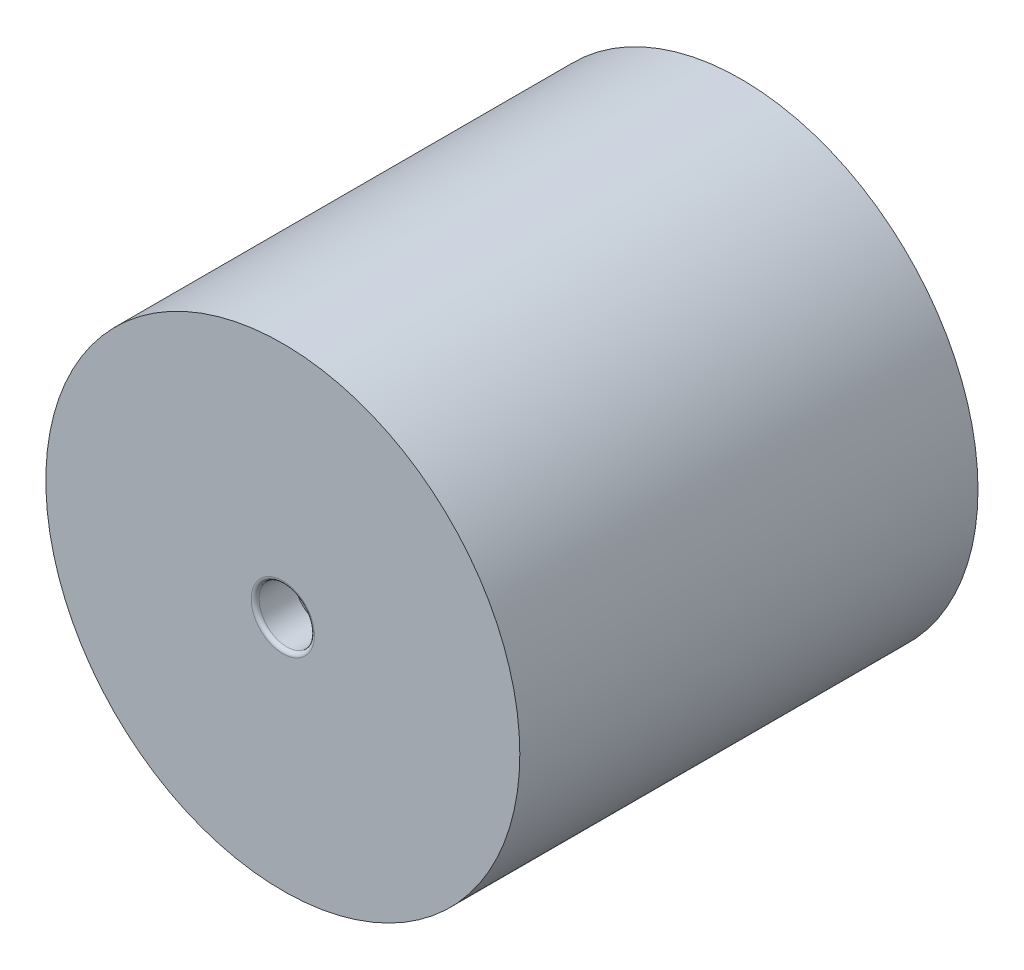
ISO-10303-21;
HEADER;
FILE_DESCRIPTION(('STEP AP214'),'2;1');
FILE_NAME('part.step','',(''),(''),'','','');
FILE_SCHEMA(('AUTOMOTIVE_DESIGN { 1 0 10303 214 1 1 1 1 }'));
ENDSEC;
DATA;
#1=APPLICATION_CONTEXT('core data for automotive mechanical design processes');
#2=APPLICATION_PROTOCOL_DEFINITION('international standard','automotive_design',2000,#1);
#3=PRODUCT_CONTEXT('',#1,'mechanical');
#4=PRODUCT('Part','Part','',(#3));
#5=PRODUCT_RELATED_PRODUCT_CATEGORY('part','',(#4));
#6=PRODUCT_DEFINITION_FORMATION('','',#4);
#7=PRODUCT_DEFINITION_CONTEXT('part definition',#1,'design');
#8=PRODUCT_DEFINITION('design','',#6,#7);
#9=PRODUCT_DEFINITION_SHAPE('','',#8);
#10=(LENGTH_UNIT() NAMED_UNIT(*) SI_UNIT(.MILLI.,.METRE.));
#11=(NAMED_UNIT(*) PLANE_ANGLE_UNIT() SI_UNIT($,.RADIAN.));
#12=(NAMED_UNIT(*) SI_UNIT($,.STERADIAN.) SOLID_ANGLE_UNIT());
#13=UNCERTAINTY_MEASURE_WITH_UNIT(LENGTH_MEASURE(1.E-05),#10,'distance_accuracy_value','');
#14=(GEOMETRIC_REPRESENTATION_CONTEXT(3) GLOBAL_UNCERTAINTY_ASSIGNED_CONTEXT((#13)) GLOBAL_UNIT_ASSIGNED_CONTEXT((#10,
#11,#12)) REPRESENTATION_CONTEXT('',''));
#15=CARTESIAN_POINT('',(0.,0.,0.));
#16=DIRECTION('',(0.,0.,1.));
#17=DIRECTION('',(1.,0.,0.));
#18=AXIS2_PLACEMENT_3D('',#15,#16,#17);
#19=CARTESIAN_POINT('',(0.,0.,29.));
#20=DIRECTION('',(0.,0.,-1.));
#21=DIRECTION('',(-1.,0.,0.));
#22=AXIS2_PLACEMENT_3D('',#19,#20,#21);
#23=CYLINDRICAL_SURFACE('',#22,30.);
#24=CARTESIAN_POINT('',(0.,0.,29.));
#25=DIRECTION('',(0.,0.,1.));
#26=DIRECTION('',(1.,0.,0.));
#27=AXIS2_PLACEMENT_3D('',#24,#25,#26);
#28=CIRCLE('',#27,30.);
#29=CARTESIAN_POINT('',(30.,0.,29.));
#30=VERTEX_POINT('',#29);
#31=EDGE_CURVE('E54',#30,#30,#28,.T.);
#32=ORIENTED_EDGE('',*,*,#31,.F.);
#33=EDGE_LOOP('',(#32));
#34=FACE_BOUND('',#33,.T.);
#35=CARTESIAN_POINT('',(0.,0.,-29.));
#36=DIRECTION('',(0.,0.,1.));
#37=DIRECTION('',(1.,0.,0.));
#38=AXIS2_PLACEMENT_3D('',#35,#36,#37);
#39=CIRCLE('',#38,30.);
#40=CARTESIAN_POINT('',(30.,0.,-29.));
#41=VERTEX_POINT('',#40);
#42=EDGE_CURVE('E55',#41,#41,#39,.T.);
#43=ORIENTED_EDGE('',*,*,#42,.T.);
#44=EDGE_LOOP('',(#43));
#45=FACE_BOUND('',#44,.T.);
#46=ADVANCED_FACE('F34',(#34,#45),#23,.T.);
#47=CARTESIAN_POINT('',(0.,0.,29.));
#48=DIRECTION('',(0.,0.,1.));
#49=DIRECTION('',(1.,0.,0.));
#50=AXIS2_PLACEMENT_3D('',#47,#48,#49);
#51=PLANE('',#50);
#52=CARTESIAN_POINT('',(0.,0.,29.));
#53=DIRECTION('',(0.,0.,1.));
#54=DIRECTION('',(1.,0.,0.));
#55=AXIS2_PLACEMENT_3D('',#52,#53,#54);
#56=CIRCLE('',#55,4.);
#57=CARTESIAN_POINT('',(4.,0.,29.));
#58=VERTEX_POINT('',#57);
#59=EDGE_CURVE('E10',#58,#58,#56,.F.);
#60=ORIENTED_EDGE('',*,*,#59,.T.);
#61=EDGE_LOOP('',(#60));
#62=FACE_BOUND('',#61,.T.);
#63=ORIENTED_EDGE('',*,*,#31,.T.);
#64=EDGE_LOOP('',(#63));
#65=FACE_BOUND('',#64,.T.);
#66=ADVANCED_FACE('F83',(#62,#65),#51,.T.);
#67=CARTESIAN_POINT('',(0.,0.,-29.));
#68=DIRECTION('',(0.,0.,1.));
#69=DIRECTION('',(1.,0.,0.));
#70=AXIS2_PLACEMENT_3D('',#67,#68,#69);
#71=PLANE('',#70);
#72=CARTESIAN_POINT('',(0.,0.,-29.));
#73=DIRECTION('',(0.,0.,1.));
#74=DIRECTION('',(1.,0.,0.));
#75=AXIS2_PLACEMENT_3D('',#72,#73,#74);
#76=CIRCLE('',#75,4.);
#77=CARTESIAN_POINT('',(4.,0.,-29.));
#78=VERTEX_POINT('',#77);
#79=EDGE_CURVE('E45',#78,#78,#76,.T.);
#80=ORIENTED_EDGE('',*,*,#79,.T.);
#81=EDGE_LOOP('',(#80));
#82=FACE_BOUND('',#81,.T.);
#83=ORIENTED_EDGE('',*,*,#42,.F.);
#84=EDGE_LOOP('',(#83));
#85=FACE_BOUND('',#84,.T.);
#86=ADVANCED_FACE('F89',(#82,#85),#71,.F.);
#87=CARTESIAN_POINT('',(0.,0.,-24.));
#88=DIRECTION('',(0.,0.,-1.));
#89=DIRECTION('',(-1.,0.,0.));
#90=AXIS2_PLACEMENT_3D('',#87,#88,#89);
#91=CYLINDRICAL_SURFACE('',#90,3.5);
#92=CARTESIAN_POINT('',(0.,0.,-28.5));
#93=DIRECTION('',(0.,0.,1.));
#94=DIRECTION('',(1.,0.,0.));
#95=AXIS2_PLACEMENT_3D('',#92,#93,#94);
#96=CIRCLE('',#95,3.5);
#97=CARTESIAN_POINT('',(3.5,0.,-28.5));
#98=VERTEX_POINT('',#97);
#99=EDGE_CURVE('E49',#98,#98,#96,.F.);
#100=ORIENTED_EDGE('',*,*,#99,.T.);
#101=EDGE_LOOP('',(#100));
#102=FACE_BOUND('',#101,.T.);
#103=CARTESIAN_POINT('',(0.,0.,-24.));
#104=DIRECTION('',(0.,0.,-1.));
#105=DIRECTION('',(-1.,0.,0.));
#106=AXIS2_PLACEMENT_3D('',#103,#104,#105);
#107=CIRCLE('',#106,3.5);
#108=CARTESIAN_POINT('',(-3.5,0.,-24.));
#109=VERTEX_POINT('',#108);
#110=EDGE_CURVE('E58',#109,#109,#107,.T.);
#111=ORIENTED_EDGE('',*,*,#110,.F.);
#112=EDGE_LOOP('',(#111));
#113=FACE_BOUND('',#112,.T.);
#114=ADVANCED_FACE('F79',(#102,#113),#91,.F.);
#115=CARTESIAN_POINT('',(0.,0.,-24.));
#116=DIRECTION('',(0.,0.,-1.));
#117=DIRECTION('',(-1.,0.,0.));
#118=AXIS2_PLACEMENT_3D('',#115,#116,#117);
#119=PLANE('',#118);
#120=ORIENTED_EDGE('',*,*,#110,.T.);
#121=EDGE_LOOP('',(#120));
#122=FACE_BOUND('',#121,.T.);
#123=ADVANCED_FACE('F71',(#122),#119,.T.);
#124=CARTESIAN_POINT('',(0.,0.,24.));
#125=DIRECTION('',(0.,0.,1.));
#126=DIRECTION('',(1.,0.,0.));
#127=AXIS2_PLACEMENT_3D('',#124,#125,#126);
#128=CYLINDRICAL_SURFACE('',#127,3.5);
#129=CARTESIAN_POINT('',(0.,0.,28.5));
#130=DIRECTION('',(0.,0.,1.));
#131=DIRECTION('',(1.,0.,0.));
#132=AXIS2_PLACEMENT_3D('',#129,#130,#131);
#133=CIRCLE('',#132,3.5);
#134=CARTESIAN_POINT('',(3.5,0.,28.5));
#135=VERTEX_POINT('',#134);
#136=EDGE_CURVE('E41',#135,#135,#133,.T.);
#137=ORIENTED_EDGE('',*,*,#136,.T.);
#138=EDGE_LOOP('',(#137));
#139=FACE_BOUND('',#138,.T.);
#140=CARTESIAN_POINT('',(0.,0.,24.));
#141=DIRECTION('',(0.,0.,1.));
#142=DIRECTION('',(1.,0.,0.));
#143=AXIS2_PLACEMENT_3D('',#140,#141,#142);
#144=CIRCLE('',#143,3.5);
#145=CARTESIAN_POINT('',(3.5,0.,24.));
#146=VERTEX_POINT('',#145);
#147=EDGE_CURVE('E63',#146,#146,#144,.T.);
#148=ORIENTED_EDGE('',*,*,#147,.F.);
#149=EDGE_LOOP('',(#148));
#150=FACE_BOUND('',#149,.T.);
#151=ADVANCED_FACE('F69',(#139,#150),#128,.F.);
#152=CARTESIAN_POINT('',(0.,0.,24.));
#153=DIRECTION('',(0.,0.,1.));
#154=DIRECTION('',(1.,0.,0.));
#155=AXIS2_PLACEMENT_3D('',#152,#153,#154);
#156=PLANE('',#155);
#157=ORIENTED_EDGE('',*,*,#147,.T.);
#158=EDGE_LOOP('',(#157));
#159=FACE_BOUND('',#158,.T.);
#160=ADVANCED_FACE('F67',(#159),#156,.T.);
#161=CARTESIAN_POINT('',(0.,0.,-28.5));
#162=DIRECTION('',(0.,0.,1.));
#163=DIRECTION('',(1.,0.,0.));
#164=AXIS2_PLACEMENT_3D('',#161,#162,#163);
#165=TOROIDAL_SURFACE('',#164,4.,0.5);
#166=ORIENTED_EDGE('',*,*,#79,.F.);
#167=EDGE_LOOP('',(#166));
#168=FACE_BOUND('',#167,.T.);
#169=ORIENTED_EDGE('',*,*,#99,.F.);
#170=EDGE_LOOP('',(#169));
#171=FACE_BOUND('',#170,.T.);
#172=ADVANCED_FACE('F77',(#168,#171),#165,.T.);
#173=CARTESIAN_POINT('',(0.,0.,28.5));
#174=DIRECTION('',(0.,0.,1.));
#175=DIRECTION('',(1.,0.,0.));
#176=AXIS2_PLACEMENT_3D('',#173,#174,#175);
#177=TOROIDAL_SURFACE('',#176,4.,0.5);
#178=ORIENTED_EDGE('',*,*,#59,.F.);
#179=EDGE_LOOP('',(#178));
#180=FACE_BOUND('',#179,.T.);
#181=ORIENTED_EDGE('',*,*,#136,.F.);
#182=EDGE_LOOP('',(#181));
#183=FACE_BOUND('',#182,.T.);
#184=ADVANCED_FACE('F36',(#180,#183),#177,.T.);
#185=CLOSED_SHELL('',(#46,#66,#86,#114,#123,#151,#160,#172,#184));
#186=MANIFOLD_SOLID_BREP('B2',#185);
#187=ADVANCED_BREP_SHAPE_REPRESENTATION('',(#18,#186),#14);
#188=SHAPE_DEFINITION_REPRESENTATION(#9,#187);
ENDSEC;
END-ISO-10303-21;
